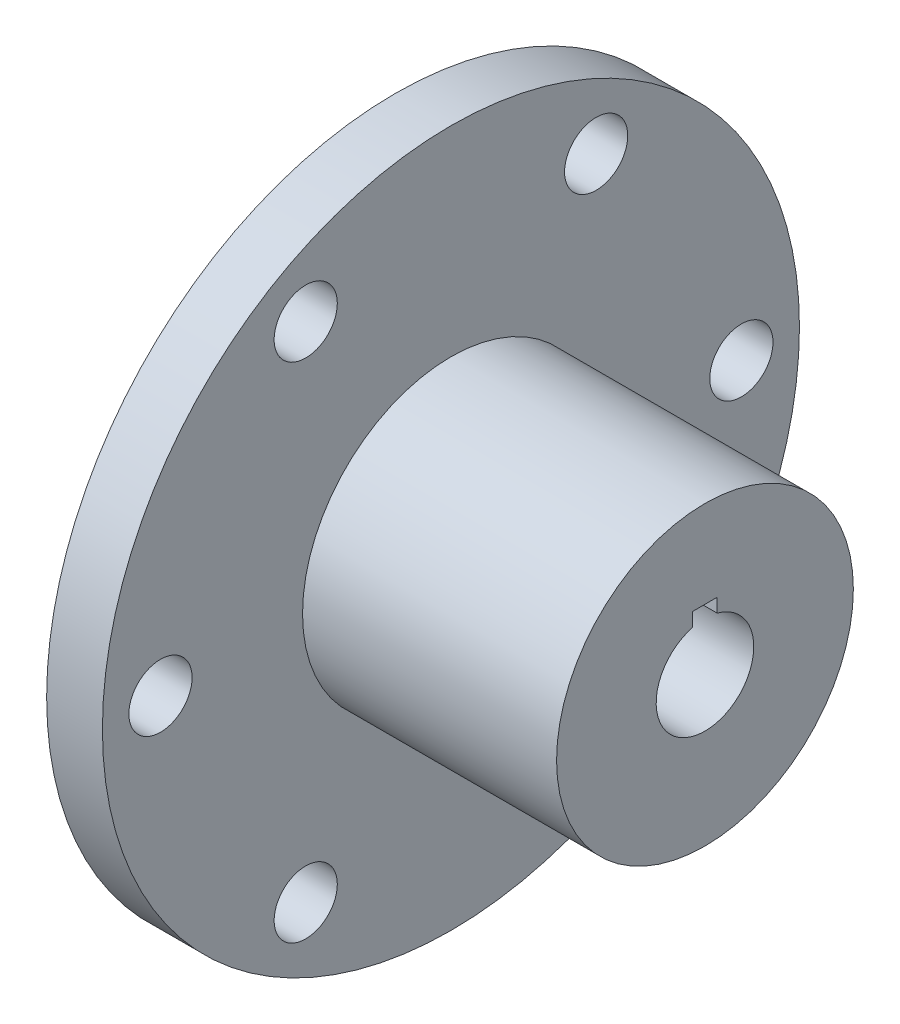
ISO-10303-21;
HEADER;
FILE_DESCRIPTION(('STEP AP214'),'2;1');
FILE_NAME('part.step','',(''),(''),'','','');
FILE_SCHEMA(('AUTOMOTIVE_DESIGN { 1 0 10303 214 1 1 1 1 }'));
ENDSEC;
DATA;
#1=APPLICATION_CONTEXT('core data for automotive mechanical design processes');
#2=APPLICATION_PROTOCOL_DEFINITION('international standard','automotive_design',2000,#1);
#3=PRODUCT_CONTEXT('',#1,'mechanical');
#4=PRODUCT('Part','Part','',(#3));
#5=PRODUCT_RELATED_PRODUCT_CATEGORY('part','',(#4));
#6=PRODUCT_DEFINITION_FORMATION('','',#4);
#7=PRODUCT_DEFINITION_CONTEXT('part definition',#1,'design');
#8=PRODUCT_DEFINITION('design','',#6,#7);
#9=PRODUCT_DEFINITION_SHAPE('','',#8);
#10=(LENGTH_UNIT() NAMED_UNIT(*) SI_UNIT(.MILLI.,.METRE.));
#11=(NAMED_UNIT(*) PLANE_ANGLE_UNIT() SI_UNIT($,.RADIAN.));
#12=(NAMED_UNIT(*) SI_UNIT($,.STERADIAN.) SOLID_ANGLE_UNIT());
#13=UNCERTAINTY_MEASURE_WITH_UNIT(LENGTH_MEASURE(1.E-05),#10,'distance_accuracy_value','');
#14=(GEOMETRIC_REPRESENTATION_CONTEXT(3) GLOBAL_UNCERTAINTY_ASSIGNED_CONTEXT((#13)) GLOBAL_UNIT_ASSIGNED_CONTEXT((#10,
#11,#12)) REPRESENTATION_CONTEXT('',''));
#15=CARTESIAN_POINT('',(0.,0.,0.));
#16=DIRECTION('',(0.,0.,1.));
#17=DIRECTION('',(1.,0.,0.));
#18=AXIS2_PLACEMENT_3D('',#15,#16,#17);
#19=CARTESIAN_POINT('',(-13.0350662460568,0.,0.));
#20=DIRECTION('',(1.,0.,0.));
#21=DIRECTION('',(0.,0.,-1.));
#22=AXIS2_PLACEMENT_3D('',#19,#20,#21);
#23=PLANE('',#22);
#24=CARTESIAN_POINT('',(-13.0350662460568,0.,23.8125));
#25=DIRECTION('',(1.,0.,0.));
#26=DIRECTION('',(0.,0.,-1.));
#27=AXIS2_PLACEMENT_3D('',#24,#25,#26);
#28=CIRCLE('',#27,2.59080000000001);
#29=CARTESIAN_POINT('',(-13.0350662460568,0.,21.2217));
#30=VERTEX_POINT('',#29);
#31=EDGE_CURVE('E180',#30,#30,#28,.T.);
#32=ORIENTED_EDGE('',*,*,#31,.F.);
#33=EDGE_LOOP('',(#32));
#34=FACE_BOUND('',#33,.T.);
#35=CARTESIAN_POINT('',(-13.0350662460568,20.6222299276169,11.90625));
#36=DIRECTION('',(1.,0.,0.));
#37=DIRECTION('',(0.,0.,-1.));
#38=AXIS2_PLACEMENT_3D('',#35,#36,#37);
#39=CIRCLE('',#38,2.59080000000001);
#40=CARTESIAN_POINT('',(-13.0350662460568,20.6222299276169,9.31544999999999));
#41=VERTEX_POINT('',#40);
#42=EDGE_CURVE('E190',#41,#41,#39,.T.);
#43=ORIENTED_EDGE('',*,*,#42,.F.);
#44=EDGE_LOOP('',(#43));
#45=FACE_BOUND('',#44,.T.);
#46=CARTESIAN_POINT('',(-13.0350662460568,20.6222299276169,-11.90625));
#47=DIRECTION('',(1.,0.,0.));
#48=DIRECTION('',(0.,0.,-1.));
#49=AXIS2_PLACEMENT_3D('',#46,#47,#48);
#50=CIRCLE('',#49,2.59080000000001);
#51=CARTESIAN_POINT('',(-13.0350662460568,20.6222299276169,-14.49705));
#52=VERTEX_POINT('',#51);
#53=EDGE_CURVE('E196',#52,#52,#50,.T.);
#54=ORIENTED_EDGE('',*,*,#53,.F.);
#55=EDGE_LOOP('',(#54));
#56=FACE_BOUND('',#55,.T.);
#57=CARTESIAN_POINT('',(-13.0350662460568,0.,-23.8125));
#58=DIRECTION('',(1.,0.,0.));
#59=DIRECTION('',(0.,0.,-1.));
#60=AXIS2_PLACEMENT_3D('',#57,#58,#59);
#61=CIRCLE('',#60,2.59080000000001);
#62=CARTESIAN_POINT('',(-13.0350662460568,0.,-26.4033));
#63=VERTEX_POINT('',#62);
#64=EDGE_CURVE('E202',#63,#63,#61,.T.);
#65=ORIENTED_EDGE('',*,*,#64,.F.);
#66=EDGE_LOOP('',(#65));
#67=FACE_BOUND('',#66,.T.);
#68=CARTESIAN_POINT('',(-13.0350662460568,-20.6222299276169,-11.90625));
#69=DIRECTION('',(1.,0.,0.));
#70=DIRECTION('',(0.,0.,-1.));
#71=AXIS2_PLACEMENT_3D('',#68,#69,#70);
#72=CIRCLE('',#71,2.59080000000001);
#73=CARTESIAN_POINT('',(-13.0350662460568,-20.6222299276169,-14.49705));
#74=VERTEX_POINT('',#73);
#75=EDGE_CURVE('E208',#74,#74,#72,.T.);
#76=ORIENTED_EDGE('',*,*,#75,.F.);
#77=EDGE_LOOP('',(#76));
#78=FACE_BOUND('',#77,.T.);
#79=CARTESIAN_POINT('',(-13.0350662460568,-20.6222299276169,11.90625));
#80=DIRECTION('',(1.,0.,0.));
#81=DIRECTION('',(0.,0.,-1.));
#82=AXIS2_PLACEMENT_3D('',#79,#80,#81);
#83=CIRCLE('',#82,2.59080000000001);
#84=CARTESIAN_POINT('',(-13.0350662460568,-20.6222299276169,9.31544999999999));
#85=VERTEX_POINT('',#84);
#86=EDGE_CURVE('E92',#85,#85,#83,.T.);
#87=ORIENTED_EDGE('',*,*,#86,.F.);
#88=EDGE_LOOP('',(#87));
#89=FACE_BOUND('',#88,.T.);
#90=CARTESIAN_POINT('',(-13.0350662460568,0.,0.));
#91=DIRECTION('',(1.,0.,0.));
#92=DIRECTION('',(0.,0.,-1.));
#93=AXIS2_PLACEMENT_3D('',#90,#91,#92);
#94=CIRCLE('',#93,28.575);
#95=CARTESIAN_POINT('',(-13.0350662460568,0.,-28.575));
#96=VERTEX_POINT('',#95);
#97=EDGE_CURVE('E41',#96,#96,#94,.T.);
#98=ORIENTED_EDGE('',*,*,#97,.T.);
#99=EDGE_LOOP('',(#98));
#100=FACE_BOUND('',#99,.T.);
#101=CARTESIAN_POINT('',(-13.0350662460568,0.,0.));
#102=DIRECTION('',(1.,0.,0.));
#103=DIRECTION('',(0.,0.,-1.));
#104=AXIS2_PLACEMENT_3D('',#101,#102,#103);
#105=CIRCLE('',#104,12.1666);
#106=CARTESIAN_POINT('',(-13.0350662460568,0.,-12.1666));
#107=VERTEX_POINT('',#106);
#108=EDGE_CURVE('E80',#107,#107,#105,.T.);
#109=ORIENTED_EDGE('',*,*,#108,.F.);
#110=EDGE_LOOP('',(#109));
#111=FACE_BOUND('',#110,.T.);
#112=ADVANCED_FACE('F33',(#34,#45,#56,#67,#78,#89,#100,#111),#23,.T.);
#113=CARTESIAN_POINT('',(-17.6070662460568,0.,0.));
#114=DIRECTION('',(1.,0.,0.));
#115=DIRECTION('',(0.,0.,-1.));
#116=AXIS2_PLACEMENT_3D('',#113,#114,#115);
#117=CYLINDRICAL_SURFACE('',#116,28.575);
#118=CARTESIAN_POINT('',(-17.6070662460568,0.,0.));
#119=DIRECTION('',(1.,0.,0.));
#120=DIRECTION('',(0.,0.,-1.));
#121=AXIS2_PLACEMENT_3D('',#118,#119,#120);
#122=CIRCLE('',#121,28.575);
#123=CARTESIAN_POINT('',(-17.6070662460568,0.,-28.575));
#124=VERTEX_POINT('',#123);
#125=EDGE_CURVE('E11',#124,#124,#122,.T.);
#126=ORIENTED_EDGE('',*,*,#125,.T.);
#127=EDGE_LOOP('',(#126));
#128=FACE_BOUND('',#127,.T.);
#129=ORIENTED_EDGE('',*,*,#97,.F.);
#130=EDGE_LOOP('',(#129));
#131=FACE_BOUND('',#130,.T.);
#132=ADVANCED_FACE('F35',(#128,#131),#117,.T.);
#133=CARTESIAN_POINT('',(-17.6070662460568,28.575,0.));
#134=DIRECTION('',(-1.,0.,0.));
#135=DIRECTION('',(0.,0.,1.));
#136=AXIS2_PLACEMENT_3D('',#133,#134,#135);
#137=PLANE('',#136);
#138=CARTESIAN_POINT('',(-17.6070662460568,0.,23.8125));
#139=DIRECTION('',(-1.,0.,0.));
#140=DIRECTION('',(0.,0.,1.));
#141=AXIS2_PLACEMENT_3D('',#138,#139,#140);
#142=CIRCLE('',#141,2.59080000000001);
#143=CARTESIAN_POINT('',(-17.6070662460568,0.,26.4033));
#144=VERTEX_POINT('',#143);
#145=EDGE_CURVE('E183',#144,#144,#142,.T.);
#146=ORIENTED_EDGE('',*,*,#145,.F.);
#147=EDGE_LOOP('',(#146));
#148=FACE_BOUND('',#147,.T.);
#149=CARTESIAN_POINT('',(-17.6070662460568,20.6222299276169,11.90625));
#150=DIRECTION('',(-1.,0.,0.));
#151=DIRECTION('',(0.,0.,1.));
#152=AXIS2_PLACEMENT_3D('',#149,#150,#151);
#153=CIRCLE('',#152,2.59080000000001);
#154=CARTESIAN_POINT('',(-17.6070662460568,20.6222299276169,14.49705));
#155=VERTEX_POINT('',#154);
#156=EDGE_CURVE('E185',#155,#155,#153,.T.);
#157=ORIENTED_EDGE('',*,*,#156,.F.);
#158=EDGE_LOOP('',(#157));
#159=FACE_BOUND('',#158,.T.);
#160=CARTESIAN_POINT('',(-17.6070662460568,20.6222299276169,-11.90625));
#161=DIRECTION('',(-1.,0.,0.));
#162=DIRECTION('',(0.,0.,1.));
#163=AXIS2_PLACEMENT_3D('',#160,#161,#162);
#164=CIRCLE('',#163,2.59080000000001);
#165=CARTESIAN_POINT('',(-17.6070662460568,20.6222299276169,-9.31544999999999));
#166=VERTEX_POINT('',#165);
#167=EDGE_CURVE('E193',#166,#166,#164,.T.);
#168=ORIENTED_EDGE('',*,*,#167,.F.);
#169=EDGE_LOOP('',(#168));
#170=FACE_BOUND('',#169,.T.);
#171=CARTESIAN_POINT('',(-17.6070662460568,0.,-23.8125));
#172=DIRECTION('',(-1.,0.,0.));
#173=DIRECTION('',(0.,0.,1.));
#174=AXIS2_PLACEMENT_3D('',#171,#172,#173);
#175=CIRCLE('',#174,2.59080000000001);
#176=CARTESIAN_POINT('',(-17.6070662460568,0.,-21.2217));
#177=VERTEX_POINT('',#176);
#178=EDGE_CURVE('E199',#177,#177,#175,.T.);
#179=ORIENTED_EDGE('',*,*,#178,.F.);
#180=EDGE_LOOP('',(#179));
#181=FACE_BOUND('',#180,.T.);
#182=CARTESIAN_POINT('',(-17.6070662460568,-20.6222299276169,-11.90625));
#183=DIRECTION('',(-1.,0.,0.));
#184=DIRECTION('',(0.,0.,1.));
#185=AXIS2_PLACEMENT_3D('',#182,#183,#184);
#186=CIRCLE('',#185,2.59080000000001);
#187=CARTESIAN_POINT('',(-17.6070662460568,-20.6222299276169,-9.31544999999999));
#188=VERTEX_POINT('',#187);
#189=EDGE_CURVE('E205',#188,#188,#186,.T.);
#190=ORIENTED_EDGE('',*,*,#189,.F.);
#191=EDGE_LOOP('',(#190));
#192=FACE_BOUND('',#191,.T.);
#193=CARTESIAN_POINT('',(-17.6070662460568,-20.6222299276169,11.90625));
#194=DIRECTION('',(-1.,0.,0.));
#195=DIRECTION('',(0.,0.,1.));
#196=AXIS2_PLACEMENT_3D('',#193,#194,#195);
#197=CIRCLE('',#196,2.59080000000001);
#198=CARTESIAN_POINT('',(-17.6070662460568,-20.6222299276169,14.49705));
#199=VERTEX_POINT('',#198);
#200=EDGE_CURVE('E211',#199,#199,#197,.T.);
#201=ORIENTED_EDGE('',*,*,#200,.F.);
#202=EDGE_LOOP('',(#201));
#203=FACE_BOUND('',#202,.T.);
#204=CARTESIAN_POINT('',(-17.6070662460568,0.,0.));
#205=DIRECTION('',(-1.,0.,0.));
#206=DIRECTION('',(0.,0.,1.));
#207=AXIS2_PLACEMENT_3D('',#204,#205,#206);
#208=CIRCLE('',#207,4.0005);
#209=CARTESIAN_POINT('',(-17.6070662460568,3.87264629936688,-1.0033));
#210=VERTEX_POINT('',#209);
#211=CARTESIAN_POINT('',(-17.6070662460568,3.87264629936688,1.0033));
#212=VERTEX_POINT('',#211);
#213=EDGE_CURVE('E48',#210,#212,#208,.T.);
#214=ORIENTED_EDGE('',*,*,#213,.F.);
#215=DIRECTION('',(0.,-1.,0.));
#216=VECTOR('',#215,1.);
#217=CARTESIAN_POINT('',(-17.6070662460568,5.0038,-1.0033));
#218=LINE('',#217,#216);
#219=CARTESIAN_POINT('',(-17.6070662460568,5.0038,-1.0033));
#220=VERTEX_POINT('',#219);
#221=EDGE_CURVE('E89',#220,#210,#218,.T.);
#222=ORIENTED_EDGE('',*,*,#221,.F.);
#223=DIRECTION('',(0.,0.,-1.));
#224=VECTOR('',#223,1.);
#225=CARTESIAN_POINT('',(-17.6070662460568,5.0038,1.0033));
#226=LINE('',#225,#224);
#227=CARTESIAN_POINT('',(-17.6070662460568,5.0038,1.0033));
#228=VERTEX_POINT('',#227);
#229=EDGE_CURVE('E97',#228,#220,#226,.T.);
#230=ORIENTED_EDGE('',*,*,#229,.F.);
#231=DIRECTION('',(0.,1.,0.));
#232=VECTOR('',#231,1.);
#233=CARTESIAN_POINT('',(-17.6070662460568,3.87264629936688,1.0033));
#234=LINE('',#233,#232);
#235=EDGE_CURVE('E91',#212,#228,#234,.T.);
#236=ORIENTED_EDGE('',*,*,#235,.F.);
#237=EDGE_LOOP('',(#214,#222,#230,#236));
#238=FACE_BOUND('',#237,.T.);
#239=ORIENTED_EDGE('',*,*,#125,.F.);
#240=EDGE_LOOP('',(#239));
#241=FACE_BOUND('',#240,.T.);
#242=ADVANCED_FACE('F86',(#148,#159,#170,#181,#192,#203,#238,#241),#137,.T.);
#243=CARTESIAN_POINT('',(7.79293375394323,0.,0.));
#244=DIRECTION('',(-1.,0.,0.));
#245=DIRECTION('',(0.,0.,1.));
#246=AXIS2_PLACEMENT_3D('',#243,#244,#245);
#247=CYLINDRICAL_SURFACE('',#246,12.1666);
#248=CARTESIAN_POINT('',(7.79293375394323,0.,0.));
#249=DIRECTION('',(1.,0.,0.));
#250=DIRECTION('',(0.,0.,-1.));
#251=AXIS2_PLACEMENT_3D('',#248,#249,#250);
#252=CIRCLE('',#251,12.1666);
#253=CARTESIAN_POINT('',(7.79293375394323,0.,-12.1666));
#254=VERTEX_POINT('',#253);
#255=EDGE_CURVE('E110',#254,#254,#252,.T.);
#256=ORIENTED_EDGE('',*,*,#255,.F.);
#257=EDGE_LOOP('',(#256));
#258=FACE_BOUND('',#257,.T.);
#259=ORIENTED_EDGE('',*,*,#108,.T.);
#260=EDGE_LOOP('',(#259));
#261=FACE_BOUND('',#260,.T.);
#262=ADVANCED_FACE('F125',(#258,#261),#247,.T.);
#263=CARTESIAN_POINT('',(7.79293375394323,0.,0.));
#264=DIRECTION('',(1.,0.,0.));
#265=DIRECTION('',(0.,0.,-1.));
#266=AXIS2_PLACEMENT_3D('',#263,#264,#265);
#267=PLANE('',#266);
#268=CARTESIAN_POINT('',(7.79293375394323,0.,0.));
#269=DIRECTION('',(-1.,0.,0.));
#270=DIRECTION('',(0.,0.,1.));
#271=AXIS2_PLACEMENT_3D('',#268,#269,#270);
#272=CIRCLE('',#271,4.0005);
#273=CARTESIAN_POINT('',(7.79293375394323,3.87264629936688,-1.0033));
#274=VERTEX_POINT('',#273);
#275=CARTESIAN_POINT('',(7.79293375394323,3.87264629936688,1.0033));
#276=VERTEX_POINT('',#275);
#277=EDGE_CURVE('E75',#274,#276,#272,.T.);
#278=ORIENTED_EDGE('',*,*,#277,.T.);
#279=DIRECTION('',(0.,1.,0.));
#280=VECTOR('',#279,1.);
#281=CARTESIAN_POINT('',(7.79293375394323,3.87264629936688,1.0033));
#282=LINE('',#281,#280);
#283=CARTESIAN_POINT('',(7.79293375394323,5.0038,1.0033));
#284=VERTEX_POINT('',#283);
#285=EDGE_CURVE('E96',#276,#284,#282,.T.);
#286=ORIENTED_EDGE('',*,*,#285,.T.);
#287=DIRECTION('',(0.,0.,-1.));
#288=VECTOR('',#287,1.);
#289=CARTESIAN_POINT('',(7.79293375394323,5.0038,1.0033));
#290=LINE('',#289,#288);
#291=CARTESIAN_POINT('',(7.79293375394323,5.0038,-1.0033));
#292=VERTEX_POINT('',#291);
#293=EDGE_CURVE('E56',#284,#292,#290,.T.);
#294=ORIENTED_EDGE('',*,*,#293,.T.);
#295=DIRECTION('',(0.,-1.,0.));
#296=VECTOR('',#295,1.);
#297=CARTESIAN_POINT('',(7.79293375394323,5.0038,-1.0033));
#298=LINE('',#297,#296);
#299=EDGE_CURVE('E109',#292,#274,#298,.T.);
#300=ORIENTED_EDGE('',*,*,#299,.T.);
#301=EDGE_LOOP('',(#278,#286,#294,#300));
#302=FACE_BOUND('',#301,.T.);
#303=ORIENTED_EDGE('',*,*,#255,.T.);
#304=EDGE_LOOP('',(#303));
#305=FACE_BOUND('',#304,.T.);
#306=ADVANCED_FACE('F137',(#302,#305),#267,.T.);
#307=CARTESIAN_POINT('',(7.79293375394323,5.0038,-1.0033));
#308=DIRECTION('',(0.,0.,-1.));
#309=DIRECTION('',(0.,1.,0.));
#310=AXIS2_PLACEMENT_3D('',#307,#308,#309);
#311=PLANE('',#310);
#312=ORIENTED_EDGE('',*,*,#221,.T.);
#313=DIRECTION('',(-1.,0.,0.));
#314=VECTOR('',#313,1.);
#315=CARTESIAN_POINT('',(7.79293375394323,3.87264629936688,-1.0033));
#316=LINE('',#315,#314);
#317=EDGE_CURVE('E72',#274,#210,#316,.T.);
#318=ORIENTED_EDGE('',*,*,#317,.F.);
#319=ORIENTED_EDGE('',*,*,#299,.F.);
#320=DIRECTION('',(-1.,0.,0.));
#321=VECTOR('',#320,1.);
#322=CARTESIAN_POINT('',(7.79293375394323,5.0038,-1.0033));
#323=LINE('',#322,#321);
#324=EDGE_CURVE('E81',#292,#220,#323,.T.);
#325=ORIENTED_EDGE('',*,*,#324,.T.);
#326=EDGE_LOOP('',(#312,#318,#319,#325));
#327=FACE_BOUND('',#326,.T.);
#328=ADVANCED_FACE('F94',(#327),#311,.F.);
#329=CARTESIAN_POINT('',(7.79293375394323,5.0038,1.0033));
#330=DIRECTION('',(0.,1.,0.));
#331=DIRECTION('',(0.,0.,1.));
#332=AXIS2_PLACEMENT_3D('',#329,#330,#331);
#333=PLANE('',#332);
#334=ORIENTED_EDGE('',*,*,#229,.T.);
#335=ORIENTED_EDGE('',*,*,#324,.F.);
#336=ORIENTED_EDGE('',*,*,#293,.F.);
#337=DIRECTION('',(-1.,0.,0.));
#338=VECTOR('',#337,1.);
#339=CARTESIAN_POINT('',(7.79293375394323,5.0038,1.0033));
#340=LINE('',#339,#338);
#341=EDGE_CURVE('E105',#284,#228,#340,.T.);
#342=ORIENTED_EDGE('',*,*,#341,.T.);
#343=EDGE_LOOP('',(#334,#335,#336,#342));
#344=FACE_BOUND('',#343,.T.);
#345=ADVANCED_FACE('F145',(#344),#333,.F.);
#346=CARTESIAN_POINT('',(7.79293375394323,3.87264629936688,1.0033));
#347=DIRECTION('',(0.,0.,1.));
#348=DIRECTION('',(0.,-1.,0.));
#349=AXIS2_PLACEMENT_3D('',#346,#347,#348);
#350=PLANE('',#349);
#351=ORIENTED_EDGE('',*,*,#235,.T.);
#352=ORIENTED_EDGE('',*,*,#341,.F.);
#353=ORIENTED_EDGE('',*,*,#285,.F.);
#354=DIRECTION('',(-1.,0.,0.));
#355=VECTOR('',#354,1.);
#356=CARTESIAN_POINT('',(7.79293375394323,3.87264629936688,1.0033));
#357=LINE('',#356,#355);
#358=EDGE_CURVE('E107',#276,#212,#357,.T.);
#359=ORIENTED_EDGE('',*,*,#358,.T.);
#360=EDGE_LOOP('',(#351,#352,#353,#359));
#361=FACE_BOUND('',#360,.T.);
#362=ADVANCED_FACE('F142',(#361),#350,.F.);
#363=CARTESIAN_POINT('',(7.79293375394323,0.,0.));
#364=DIRECTION('',(-1.,0.,0.));
#365=DIRECTION('',(0.,0.,1.));
#366=AXIS2_PLACEMENT_3D('',#363,#364,#365);
#367=CYLINDRICAL_SURFACE('',#366,4.0005);
#368=ORIENTED_EDGE('',*,*,#213,.T.);
#369=ORIENTED_EDGE('',*,*,#358,.F.);
#370=ORIENTED_EDGE('',*,*,#277,.F.);
#371=ORIENTED_EDGE('',*,*,#317,.T.);
#372=EDGE_LOOP('',(#368,#369,#370,#371));
#373=FACE_BOUND('',#372,.T.);
#374=ADVANCED_FACE('F73',(#373),#367,.F.);
#375=CARTESIAN_POINT('',(-17.6070662460568,-20.6222299276169,11.90625));
#376=DIRECTION('',(-1.,0.,0.));
#377=DIRECTION('',(0.,0.,1.));
#378=AXIS2_PLACEMENT_3D('',#375,#376,#377);
#379=CYLINDRICAL_SURFACE('',#378,2.59080000000001);
#380=ORIENTED_EDGE('',*,*,#86,.T.);
#381=EDGE_LOOP('',(#380));
#382=FACE_BOUND('',#381,.T.);
#383=ORIENTED_EDGE('',*,*,#200,.T.);
#384=EDGE_LOOP('',(#383));
#385=FACE_BOUND('',#384,.T.);
#386=ADVANCED_FACE('F153',(#382,#385),#379,.F.);
#387=CARTESIAN_POINT('',(-17.6070662460568,-20.6222299276169,-11.90625));
#388=DIRECTION('',(-1.,0.,0.));
#389=DIRECTION('',(0.,0.,1.));
#390=AXIS2_PLACEMENT_3D('',#387,#388,#389);
#391=CYLINDRICAL_SURFACE('',#390,2.59080000000001);
#392=ORIENTED_EDGE('',*,*,#75,.T.);
#393=EDGE_LOOP('',(#392));
#394=FACE_BOUND('',#393,.T.);
#395=ORIENTED_EDGE('',*,*,#189,.T.);
#396=EDGE_LOOP('',(#395));
#397=FACE_BOUND('',#396,.T.);
#398=ADVANCED_FACE('F156',(#394,#397),#391,.F.);
#399=CARTESIAN_POINT('',(-17.6070662460568,0.,-23.8125));
#400=DIRECTION('',(-1.,0.,0.));
#401=DIRECTION('',(0.,0.,1.));
#402=AXIS2_PLACEMENT_3D('',#399,#400,#401);
#403=CYLINDRICAL_SURFACE('',#402,2.59080000000001);
#404=ORIENTED_EDGE('',*,*,#64,.T.);
#405=EDGE_LOOP('',(#404));
#406=FACE_BOUND('',#405,.T.);
#407=ORIENTED_EDGE('',*,*,#178,.T.);
#408=EDGE_LOOP('',(#407));
#409=FACE_BOUND('',#408,.T.);
#410=ADVANCED_FACE('F160',(#406,#409),#403,.F.);
#411=CARTESIAN_POINT('',(-17.6070662460568,20.6222299276169,-11.90625));
#412=DIRECTION('',(-1.,0.,0.));
#413=DIRECTION('',(0.,0.,1.));
#414=AXIS2_PLACEMENT_3D('',#411,#412,#413);
#415=CYLINDRICAL_SURFACE('',#414,2.59080000000001);
#416=ORIENTED_EDGE('',*,*,#53,.T.);
#417=EDGE_LOOP('',(#416));
#418=FACE_BOUND('',#417,.T.);
#419=ORIENTED_EDGE('',*,*,#167,.T.);
#420=EDGE_LOOP('',(#419));
#421=FACE_BOUND('',#420,.T.);
#422=ADVANCED_FACE('F164',(#418,#421),#415,.F.);
#423=CARTESIAN_POINT('',(-17.6070662460568,20.6222299276169,11.90625));
#424=DIRECTION('',(-1.,0.,0.));
#425=DIRECTION('',(0.,0.,1.));
#426=AXIS2_PLACEMENT_3D('',#423,#424,#425);
#427=CYLINDRICAL_SURFACE('',#426,2.59080000000001);
#428=ORIENTED_EDGE('',*,*,#42,.T.);
#429=EDGE_LOOP('',(#428));
#430=FACE_BOUND('',#429,.T.);
#431=ORIENTED_EDGE('',*,*,#156,.T.);
#432=EDGE_LOOP('',(#431));
#433=FACE_BOUND('',#432,.T.);
#434=ADVANCED_FACE('F168',(#430,#433),#427,.F.);
#435=CARTESIAN_POINT('',(-17.6070662460568,0.,23.8125));
#436=DIRECTION('',(-1.,0.,0.));
#437=DIRECTION('',(0.,0.,1.));
#438=AXIS2_PLACEMENT_3D('',#435,#436,#437);
#439=CYLINDRICAL_SURFACE('',#438,2.59080000000001);
#440=ORIENTED_EDGE('',*,*,#31,.T.);
#441=EDGE_LOOP('',(#440));
#442=FACE_BOUND('',#441,.T.);
#443=ORIENTED_EDGE('',*,*,#145,.T.);
#444=EDGE_LOOP('',(#443));
#445=FACE_BOUND('',#444,.T.);
#446=ADVANCED_FACE('F172',(#442,#445),#439,.F.);
#447=CLOSED_SHELL('',(#112,#132,#242,#262,#306,#328,#345,#362,#374,#386,#398,#410,#422,#434,#446));
#448=MANIFOLD_SOLID_BREP('B2',#447);
#449=ADVANCED_BREP_SHAPE_REPRESENTATION('',(#18,#448),#14);
#450=SHAPE_DEFINITION_REPRESENTATION(#9,#449);
ENDSEC;
END-ISO-10303-21;
